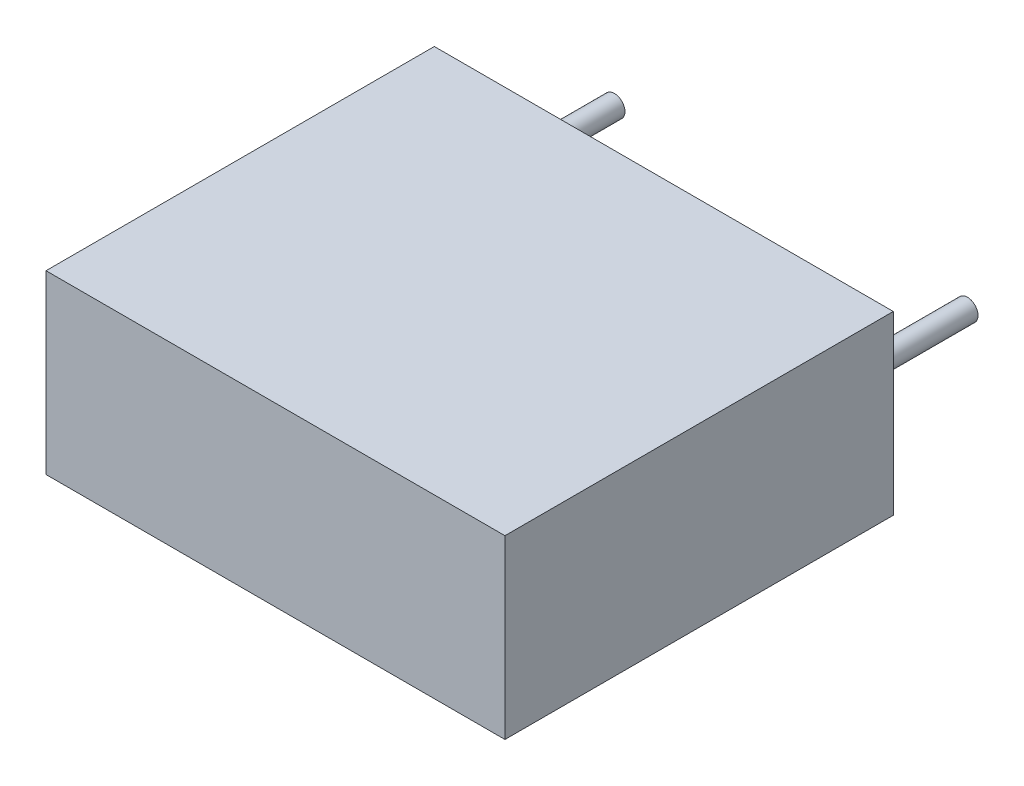
ISO-10303-21;
HEADER;
FILE_DESCRIPTION(('STEP AP214'),'2;1');
FILE_NAME('part.step','',(''),(''),'','','');
FILE_SCHEMA(('AUTOMOTIVE_DESIGN { 1 0 10303 214 1 1 1 1 }'));
ENDSEC;
DATA;
#1=APPLICATION_CONTEXT('core data for automotive mechanical design processes');
#2=APPLICATION_PROTOCOL_DEFINITION('international standard','automotive_design',2000,#1);
#3=PRODUCT_CONTEXT('',#1,'mechanical');
#4=PRODUCT('Part','Part','',(#3));
#5=PRODUCT_RELATED_PRODUCT_CATEGORY('part','',(#4));
#6=PRODUCT_DEFINITION_FORMATION('','',#4);
#7=PRODUCT_DEFINITION_CONTEXT('part definition',#1,'design');
#8=PRODUCT_DEFINITION('design','',#6,#7);
#9=PRODUCT_DEFINITION_SHAPE('','',#8);
#10=(LENGTH_UNIT() NAMED_UNIT(*) SI_UNIT(.MILLI.,.METRE.));
#11=(NAMED_UNIT(*) PLANE_ANGLE_UNIT() SI_UNIT($,.RADIAN.));
#12=(NAMED_UNIT(*) SI_UNIT($,.STERADIAN.) SOLID_ANGLE_UNIT());
#13=UNCERTAINTY_MEASURE_WITH_UNIT(LENGTH_MEASURE(1.E-05),#10,'distance_accuracy_value','');
#14=(GEOMETRIC_REPRESENTATION_CONTEXT(3) GLOBAL_UNCERTAINTY_ASSIGNED_CONTEXT((#13)) GLOBAL_UNIT_ASSIGNED_CONTEXT((#10,
#11,#12)) REPRESENTATION_CONTEXT('',''));
#15=CARTESIAN_POINT('',(0.,0.,0.));
#16=DIRECTION('',(0.,0.,1.));
#17=DIRECTION('',(1.,0.,0.));
#18=AXIS2_PLACEMENT_3D('',#15,#16,#17);
#19=CARTESIAN_POINT('',(6.5,-2.5,11.));
#20=DIRECTION('',(-1.,0.,0.));
#21=DIRECTION('',(0.,0.,1.));
#22=AXIS2_PLACEMENT_3D('',#19,#20,#21);
#23=PLANE('',#22);
#24=DIRECTION('',(0.,1.,0.));
#25=VECTOR('',#24,1.);
#26=CARTESIAN_POINT('',(6.5,-2.5,0.));
#27=LINE('',#26,#25);
#28=CARTESIAN_POINT('',(6.5,-2.5,0.));
#29=VERTEX_POINT('',#28);
#30=CARTESIAN_POINT('',(6.5,2.5,0.));
#31=VERTEX_POINT('',#30);
#32=EDGE_CURVE('E109',#29,#31,#27,.T.);
#33=ORIENTED_EDGE('',*,*,#32,.T.);
#34=DIRECTION('',(0.,0.,-1.));
#35=VECTOR('',#34,1.);
#36=CARTESIAN_POINT('',(6.5,2.5,11.));
#37=LINE('',#36,#35);
#38=CARTESIAN_POINT('',(6.5,2.5,11.));
#39=VERTEX_POINT('',#38);
#40=EDGE_CURVE('E11',#39,#31,#37,.T.);
#41=ORIENTED_EDGE('',*,*,#40,.F.);
#42=DIRECTION('',(0.,1.,0.));
#43=VECTOR('',#42,1.);
#44=CARTESIAN_POINT('',(6.5,-2.5,11.));
#45=LINE('',#44,#43);
#46=CARTESIAN_POINT('',(6.5,-2.5,11.));
#47=VERTEX_POINT('',#46);
#48=EDGE_CURVE('E93',#47,#39,#45,.T.);
#49=ORIENTED_EDGE('',*,*,#48,.F.);
#50=DIRECTION('',(0.,0.,-1.));
#51=VECTOR('',#50,1.);
#52=CARTESIAN_POINT('',(6.5,-2.5,11.));
#53=LINE('',#52,#51);
#54=EDGE_CURVE('E105',#47,#29,#53,.T.);
#55=ORIENTED_EDGE('',*,*,#54,.T.);
#56=EDGE_LOOP('',(#33,#41,#49,#55));
#57=FACE_BOUND('',#56,.T.);
#58=ADVANCED_FACE('F41',(#57),#23,.F.);
#59=CARTESIAN_POINT('',(-6.5,2.5,11.));
#60=DIRECTION('',(0.,-1.,0.));
#61=DIRECTION('',(0.,0.,-1.));
#62=AXIS2_PLACEMENT_3D('',#59,#60,#61);
#63=PLANE('',#62);
#64=DIRECTION('',(-1.,0.,0.));
#65=VECTOR('',#64,1.);
#66=CARTESIAN_POINT('',(-6.5,2.5,0.));
#67=LINE('',#66,#65);
#68=CARTESIAN_POINT('',(-6.5,2.5,0.));
#69=VERTEX_POINT('',#68);
#70=EDGE_CURVE('E98',#31,#69,#67,.T.);
#71=ORIENTED_EDGE('',*,*,#70,.T.);
#72=DIRECTION('',(0.,0.,-1.));
#73=VECTOR('',#72,1.);
#74=CARTESIAN_POINT('',(-6.5,2.5,11.));
#75=LINE('',#74,#73);
#76=CARTESIAN_POINT('',(-6.5,2.5,11.));
#77=VERTEX_POINT('',#76);
#78=EDGE_CURVE('E50',#77,#69,#75,.T.);
#79=ORIENTED_EDGE('',*,*,#78,.F.);
#80=DIRECTION('',(-1.,0.,0.));
#81=VECTOR('',#80,1.);
#82=CARTESIAN_POINT('',(-6.5,2.5,11.));
#83=LINE('',#82,#81);
#84=EDGE_CURVE('E88',#39,#77,#83,.T.);
#85=ORIENTED_EDGE('',*,*,#84,.F.);
#86=ORIENTED_EDGE('',*,*,#40,.T.);
#87=EDGE_LOOP('',(#71,#79,#85,#86));
#88=FACE_BOUND('',#87,.T.);
#89=ADVANCED_FACE('F97',(#88),#63,.F.);
#90=CARTESIAN_POINT('',(-6.5,-2.5,11.));
#91=DIRECTION('',(1.,0.,0.));
#92=DIRECTION('',(0.,0.,-1.));
#93=AXIS2_PLACEMENT_3D('',#90,#91,#92);
#94=PLANE('',#93);
#95=DIRECTION('',(0.,-1.,0.));
#96=VECTOR('',#95,1.);
#97=CARTESIAN_POINT('',(-6.5,-2.5,0.));
#98=LINE('',#97,#96);
#99=CARTESIAN_POINT('',(-6.5,-2.5,0.));
#100=VERTEX_POINT('',#99);
#101=EDGE_CURVE('E75',#69,#100,#98,.T.);
#102=ORIENTED_EDGE('',*,*,#101,.T.);
#103=DIRECTION('',(0.,0.,-1.));
#104=VECTOR('',#103,1.);
#105=CARTESIAN_POINT('',(-6.5,-2.5,11.));
#106=LINE('',#105,#104);
#107=CARTESIAN_POINT('',(-6.5,-2.5,11.));
#108=VERTEX_POINT('',#107);
#109=EDGE_CURVE('E100',#108,#100,#106,.T.);
#110=ORIENTED_EDGE('',*,*,#109,.F.);
#111=DIRECTION('',(0.,-1.,0.));
#112=VECTOR('',#111,1.);
#113=CARTESIAN_POINT('',(-6.5,-2.5,11.));
#114=LINE('',#113,#112);
#115=EDGE_CURVE('E91',#77,#108,#114,.T.);
#116=ORIENTED_EDGE('',*,*,#115,.F.);
#117=ORIENTED_EDGE('',*,*,#78,.T.);
#118=EDGE_LOOP('',(#102,#110,#116,#117));
#119=FACE_BOUND('',#118,.T.);
#120=ADVANCED_FACE('F101',(#119),#94,.F.);
#121=CARTESIAN_POINT('',(-6.5,-2.5,11.));
#122=DIRECTION('',(0.,1.,0.));
#123=DIRECTION('',(0.,0.,1.));
#124=AXIS2_PLACEMENT_3D('',#121,#122,#123);
#125=PLANE('',#124);
#126=DIRECTION('',(1.,0.,0.));
#127=VECTOR('',#126,1.);
#128=CARTESIAN_POINT('',(-6.5,-2.5,0.));
#129=LINE('',#128,#127);
#130=EDGE_CURVE('E81',#100,#29,#129,.T.);
#131=ORIENTED_EDGE('',*,*,#130,.T.);
#132=ORIENTED_EDGE('',*,*,#54,.F.);
#133=DIRECTION('',(1.,0.,0.));
#134=VECTOR('',#133,1.);
#135=CARTESIAN_POINT('',(-6.5,-2.5,11.));
#136=LINE('',#135,#134);
#137=EDGE_CURVE('E58',#108,#47,#136,.T.);
#138=ORIENTED_EDGE('',*,*,#137,.F.);
#139=ORIENTED_EDGE('',*,*,#109,.T.);
#140=EDGE_LOOP('',(#131,#132,#138,#139));
#141=FACE_BOUND('',#140,.T.);
#142=ADVANCED_FACE('F123',(#141),#125,.F.);
#143=CARTESIAN_POINT('',(0.,0.,11.));
#144=DIRECTION('',(0.,0.,-1.));
#145=DIRECTION('',(-1.,0.,0.));
#146=AXIS2_PLACEMENT_3D('',#143,#144,#145);
#147=PLANE('',#146);
#148=ORIENTED_EDGE('',*,*,#48,.T.);
#149=ORIENTED_EDGE('',*,*,#84,.T.);
#150=ORIENTED_EDGE('',*,*,#115,.T.);
#151=ORIENTED_EDGE('',*,*,#137,.T.);
#152=EDGE_LOOP('',(#148,#149,#150,#151));
#153=FACE_BOUND('',#152,.T.);
#154=ADVANCED_FACE('F89',(#153),#147,.F.);
#155=CARTESIAN_POINT('',(0.,0.,0.));
#156=DIRECTION('',(0.,0.,-1.));
#157=DIRECTION('',(-1.,0.,0.));
#158=AXIS2_PLACEMENT_3D('',#155,#156,#157);
#159=PLANE('',#158);
#160=CARTESIAN_POINT('',(-5.,0.,0.));
#161=DIRECTION('',(0.,0.,-1.));
#162=DIRECTION('',(-1.,0.,0.));
#163=AXIS2_PLACEMENT_3D('',#160,#161,#162);
#164=CIRCLE('',#163,0.3);
#165=CARTESIAN_POINT('',(-5.3,0.,0.));
#166=VERTEX_POINT('',#165);
#167=EDGE_CURVE('E138',#166,#166,#164,.T.);
#168=ORIENTED_EDGE('',*,*,#167,.F.);
#169=EDGE_LOOP('',(#168));
#170=FACE_BOUND('',#169,.T.);
#171=CARTESIAN_POINT('',(5.,0.,0.));
#172=DIRECTION('',(0.,0.,-1.));
#173=DIRECTION('',(-1.,0.,0.));
#174=AXIS2_PLACEMENT_3D('',#171,#172,#173);
#175=CIRCLE('',#174,0.3);
#176=CARTESIAN_POINT('',(4.7,0.,0.));
#177=VERTEX_POINT('',#176);
#178=EDGE_CURVE('E130',#177,#177,#175,.T.);
#179=ORIENTED_EDGE('',*,*,#178,.F.);
#180=EDGE_LOOP('',(#179));
#181=FACE_BOUND('',#180,.T.);
#182=ORIENTED_EDGE('',*,*,#32,.F.);
#183=ORIENTED_EDGE('',*,*,#130,.F.);
#184=ORIENTED_EDGE('',*,*,#101,.F.);
#185=ORIENTED_EDGE('',*,*,#70,.F.);
#186=EDGE_LOOP('',(#182,#183,#184,#185));
#187=FACE_BOUND('',#186,.T.);
#188=ADVANCED_FACE('F126',(#170,#181,#187),#159,.T.);
#189=CARTESIAN_POINT('',(5.,0.,-3.6));
#190=DIRECTION('',(0.,0.,1.));
#191=DIRECTION('',(1.,0.,0.));
#192=AXIS2_PLACEMENT_3D('',#189,#190,#191);
#193=CYLINDRICAL_SURFACE('',#192,0.3);
#194=CARTESIAN_POINT('',(5.,0.,-3.6));
#195=DIRECTION('',(0.,0.,-1.));
#196=DIRECTION('',(-1.,0.,0.));
#197=AXIS2_PLACEMENT_3D('',#194,#195,#196);
#198=CIRCLE('',#197,0.3);
#199=CARTESIAN_POINT('',(4.7,0.,-3.6));
#200=VERTEX_POINT('',#199);
#201=EDGE_CURVE('E113',#200,#200,#198,.T.);
#202=ORIENTED_EDGE('',*,*,#201,.F.);
#203=EDGE_LOOP('',(#202));
#204=FACE_BOUND('',#203,.T.);
#205=ORIENTED_EDGE('',*,*,#178,.T.);
#206=EDGE_LOOP('',(#205));
#207=FACE_BOUND('',#206,.T.);
#208=ADVANCED_FACE('F157',(#204,#207),#193,.T.);
#209=CARTESIAN_POINT('',(5.,0.,-3.6));
#210=DIRECTION('',(0.,0.,-1.));
#211=DIRECTION('',(-1.,0.,0.));
#212=AXIS2_PLACEMENT_3D('',#209,#210,#211);
#213=PLANE('',#212);
#214=ORIENTED_EDGE('',*,*,#201,.T.);
#215=EDGE_LOOP('',(#214));
#216=FACE_BOUND('',#215,.T.);
#217=ADVANCED_FACE('F151',(#216),#213,.T.);
#218=CARTESIAN_POINT('',(-5.,0.,-3.6));
#219=DIRECTION('',(0.,0.,1.));
#220=DIRECTION('',(1.,0.,0.));
#221=AXIS2_PLACEMENT_3D('',#218,#219,#220);
#222=CYLINDRICAL_SURFACE('',#221,0.3);
#223=CARTESIAN_POINT('',(-5.,0.,-3.6));
#224=DIRECTION('',(0.,0.,-1.));
#225=DIRECTION('',(-1.,0.,0.));
#226=AXIS2_PLACEMENT_3D('',#223,#224,#225);
#227=CIRCLE('',#226,0.3);
#228=CARTESIAN_POINT('',(-5.3,0.,-3.6));
#229=VERTEX_POINT('',#228);
#230=EDGE_CURVE('E134',#229,#229,#227,.T.);
#231=ORIENTED_EDGE('',*,*,#230,.F.);
#232=EDGE_LOOP('',(#231));
#233=FACE_BOUND('',#232,.T.);
#234=ORIENTED_EDGE('',*,*,#167,.T.);
#235=EDGE_LOOP('',(#234));
#236=FACE_BOUND('',#235,.T.);
#237=ADVANCED_FACE('F148',(#233,#236),#222,.T.);
#238=CARTESIAN_POINT('',(-5.,0.,-3.6));
#239=DIRECTION('',(0.,0.,-1.));
#240=DIRECTION('',(-1.,0.,0.));
#241=AXIS2_PLACEMENT_3D('',#238,#239,#240);
#242=PLANE('',#241);
#243=ORIENTED_EDGE('',*,*,#230,.T.);
#244=EDGE_LOOP('',(#243));
#245=FACE_BOUND('',#244,.T.);
#246=ADVANCED_FACE('F146',(#245),#242,.T.);
#247=CLOSED_SHELL('',(#58,#89,#120,#142,#154,#188,#208,#217,#237,#246));
#248=MANIFOLD_SOLID_BREP('B2',#247);
#249=ADVANCED_BREP_SHAPE_REPRESENTATION('',(#18,#248),#14);
#250=SHAPE_DEFINITION_REPRESENTATION(#9,#249);
ENDSEC;
END-ISO-10303-21;
